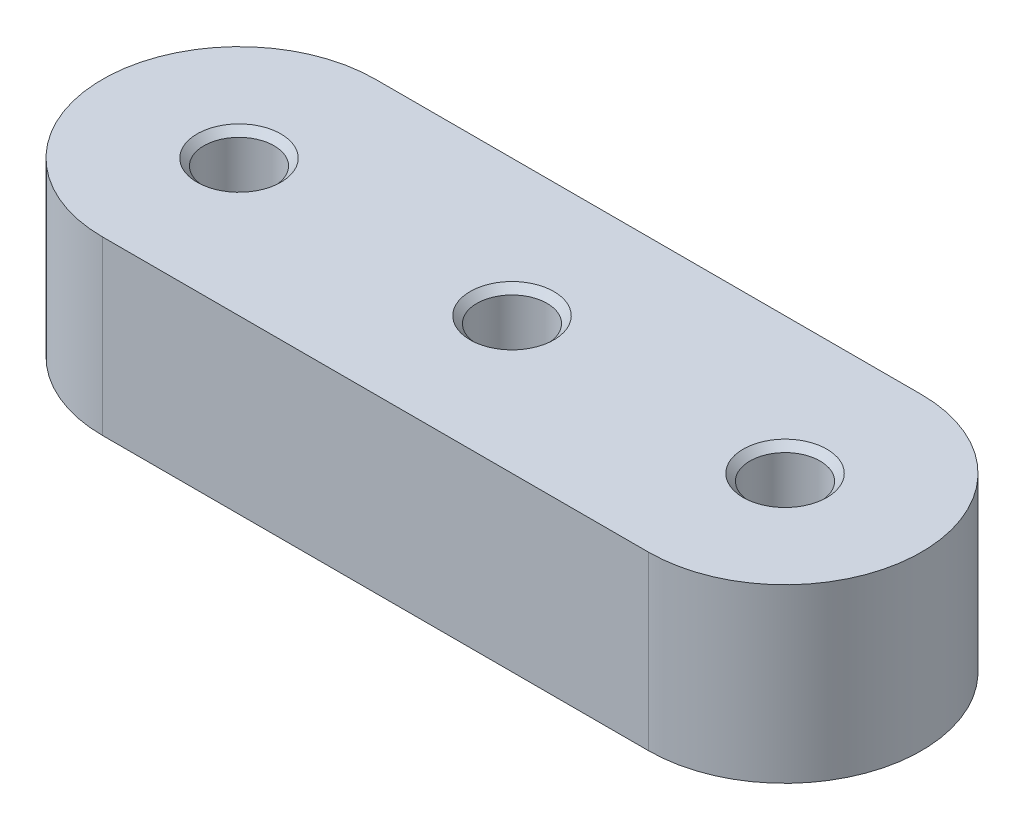
ISO-10303-21;
HEADER;
FILE_DESCRIPTION(('STEP AP214'),'2;1');
FILE_NAME('part.step','',(''),(''),'','','');
FILE_SCHEMA(('AUTOMOTIVE_DESIGN { 1 0 10303 214 1 1 1 1 }'));
ENDSEC;
DATA;
#1=APPLICATION_CONTEXT('core data for automotive mechanical design processes');
#2=APPLICATION_PROTOCOL_DEFINITION('international standard','automotive_design',2000,#1);
#3=PRODUCT_CONTEXT('',#1,'mechanical');
#4=PRODUCT('Part','Part','',(#3));
#5=PRODUCT_RELATED_PRODUCT_CATEGORY('part','',(#4));
#6=PRODUCT_DEFINITION_FORMATION('','',#4);
#7=PRODUCT_DEFINITION_CONTEXT('part definition',#1,'design');
#8=PRODUCT_DEFINITION('design','',#6,#7);
#9=PRODUCT_DEFINITION_SHAPE('','',#8);
#10=(LENGTH_UNIT() NAMED_UNIT(*) SI_UNIT(.MILLI.,.METRE.));
#11=(NAMED_UNIT(*) PLANE_ANGLE_UNIT() SI_UNIT($,.RADIAN.));
#12=(NAMED_UNIT(*) SI_UNIT($,.STERADIAN.) SOLID_ANGLE_UNIT());
#13=UNCERTAINTY_MEASURE_WITH_UNIT(LENGTH_MEASURE(1.E-05),#10,'distance_accuracy_value','');
#14=(GEOMETRIC_REPRESENTATION_CONTEXT(3) GLOBAL_UNCERTAINTY_ASSIGNED_CONTEXT((#13)) GLOBAL_UNIT_ASSIGNED_CONTEXT((#10,
#11,#12)) REPRESENTATION_CONTEXT('',''));
#15=CARTESIAN_POINT('',(0.,0.,0.));
#16=DIRECTION('',(0.,0.,1.));
#17=DIRECTION('',(1.,0.,0.));
#18=AXIS2_PLACEMENT_3D('',#15,#16,#17);
#19=CARTESIAN_POINT('',(-25.4,-16.,0.));
#20=DIRECTION('',(0.,1.,0.));
#21=DIRECTION('',(0.,0.,1.));
#22=AXIS2_PLACEMENT_3D('',#19,#20,#21);
#23=CYLINDRICAL_SURFACE('',#22,12.7);
#24=CARTESIAN_POINT('',(-25.4,0.,0.));
#25=DIRECTION('',(0.,1.,0.));
#26=DIRECTION('',(0.,0.,1.));
#27=AXIS2_PLACEMENT_3D('',#24,#25,#26);
#28=CIRCLE('',#27,12.7);
#29=CARTESIAN_POINT('',(-25.4,0.,-12.7));
#30=VERTEX_POINT('',#29);
#31=CARTESIAN_POINT('',(-25.4,0.,12.7));
#32=VERTEX_POINT('',#31);
#33=EDGE_CURVE('E99',#30,#32,#28,.T.);
#34=ORIENTED_EDGE('',*,*,#33,.F.);
#35=DIRECTION('',(0.,1.,0.));
#36=VECTOR('',#35,1.);
#37=CARTESIAN_POINT('',(-25.4,-16.,-12.7));
#38=LINE('',#37,#36);
#39=CARTESIAN_POINT('',(-25.4,-16.,-12.7));
#40=VERTEX_POINT('',#39);
#41=EDGE_CURVE('E11',#40,#30,#38,.T.);
#42=ORIENTED_EDGE('',*,*,#41,.F.);
#43=CARTESIAN_POINT('',(-25.4,-16.,0.));
#44=DIRECTION('',(0.,1.,0.));
#45=DIRECTION('',(0.,0.,1.));
#46=AXIS2_PLACEMENT_3D('',#43,#44,#45);
#47=CIRCLE('',#46,12.7);
#48=CARTESIAN_POINT('',(-25.4,-16.,12.7));
#49=VERTEX_POINT('',#48);
#50=EDGE_CURVE('E92',#40,#49,#47,.T.);
#51=ORIENTED_EDGE('',*,*,#50,.T.);
#52=DIRECTION('',(0.,1.,0.));
#53=VECTOR('',#52,1.);
#54=CARTESIAN_POINT('',(-25.4,-16.,12.7));
#55=LINE('',#54,#53);
#56=EDGE_CURVE('E37',#49,#32,#55,.T.);
#57=ORIENTED_EDGE('',*,*,#56,.T.);
#58=EDGE_LOOP('',(#34,#42,#51,#57));
#59=FACE_BOUND('',#58,.T.);
#60=ADVANCED_FACE('F34',(#59),#23,.T.);
#61=CARTESIAN_POINT('',(-25.4,-16.,-12.7));
#62=DIRECTION('',(0.,0.,-1.));
#63=DIRECTION('',(-1.,0.,0.));
#64=AXIS2_PLACEMENT_3D('',#61,#62,#63);
#65=PLANE('',#64);
#66=DIRECTION('',(-1.,0.,0.));
#67=VECTOR('',#66,1.);
#68=CARTESIAN_POINT('',(-25.4,0.,-12.7));
#69=LINE('',#68,#67);
#70=CARTESIAN_POINT('',(25.4,0.,-12.7));
#71=VERTEX_POINT('',#70);
#72=EDGE_CURVE('E94',#71,#30,#69,.T.);
#73=ORIENTED_EDGE('',*,*,#72,.F.);
#74=DIRECTION('',(0.,1.,0.));
#75=VECTOR('',#74,1.);
#76=CARTESIAN_POINT('',(25.4,-16.,-12.7));
#77=LINE('',#76,#75);
#78=CARTESIAN_POINT('',(25.4,-16.,-12.7));
#79=VERTEX_POINT('',#78);
#80=EDGE_CURVE('E43',#79,#71,#77,.T.);
#81=ORIENTED_EDGE('',*,*,#80,.F.);
#82=DIRECTION('',(-1.,0.,0.));
#83=VECTOR('',#82,1.);
#84=CARTESIAN_POINT('',(-25.4,-16.,-12.7));
#85=LINE('',#84,#83);
#86=EDGE_CURVE('E89',#79,#40,#85,.T.);
#87=ORIENTED_EDGE('',*,*,#86,.T.);
#88=ORIENTED_EDGE('',*,*,#41,.T.);
#89=EDGE_LOOP('',(#73,#81,#87,#88));
#90=FACE_BOUND('',#89,.T.);
#91=ADVANCED_FACE('F110',(#90),#65,.T.);
#92=CARTESIAN_POINT('',(25.4,-16.,0.));
#93=DIRECTION('',(0.,1.,0.));
#94=DIRECTION('',(0.,0.,1.));
#95=AXIS2_PLACEMENT_3D('',#92,#93,#94);
#96=CYLINDRICAL_SURFACE('',#95,12.7);
#97=CARTESIAN_POINT('',(25.4,0.,0.));
#98=DIRECTION('',(0.,1.,0.));
#99=DIRECTION('',(0.,0.,1.));
#100=AXIS2_PLACEMENT_3D('',#97,#98,#99);
#101=CIRCLE('',#100,12.7);
#102=CARTESIAN_POINT('',(25.4,0.,12.7));
#103=VERTEX_POINT('',#102);
#104=EDGE_CURVE('E84',#103,#71,#101,.T.);
#105=ORIENTED_EDGE('',*,*,#104,.F.);
#106=DIRECTION('',(0.,1.,0.));
#107=VECTOR('',#106,1.);
#108=CARTESIAN_POINT('',(25.4,-16.,12.7));
#109=LINE('',#108,#107);
#110=CARTESIAN_POINT('',(25.4,-16.,12.7));
#111=VERTEX_POINT('',#110);
#112=EDGE_CURVE('E79',#111,#103,#109,.T.);
#113=ORIENTED_EDGE('',*,*,#112,.F.);
#114=CARTESIAN_POINT('',(25.4,-16.,0.));
#115=DIRECTION('',(0.,1.,0.));
#116=DIRECTION('',(0.,0.,1.));
#117=AXIS2_PLACEMENT_3D('',#114,#115,#116);
#118=CIRCLE('',#117,12.7);
#119=EDGE_CURVE('E82',#111,#79,#118,.T.);
#120=ORIENTED_EDGE('',*,*,#119,.T.);
#121=ORIENTED_EDGE('',*,*,#80,.T.);
#122=EDGE_LOOP('',(#105,#113,#120,#121));
#123=FACE_BOUND('',#122,.T.);
#124=ADVANCED_FACE('F81',(#123),#96,.T.);
#125=CARTESIAN_POINT('',(-25.4,-16.,12.7));
#126=DIRECTION('',(0.,0.,1.));
#127=DIRECTION('',(1.,0.,0.));
#128=AXIS2_PLACEMENT_3D('',#125,#126,#127);
#129=PLANE('',#128);
#130=DIRECTION('',(1.,0.,0.));
#131=VECTOR('',#130,1.);
#132=CARTESIAN_POINT('',(-25.4,0.,12.7));
#133=LINE('',#132,#131);
#134=EDGE_CURVE('E102',#32,#103,#133,.T.);
#135=ORIENTED_EDGE('',*,*,#134,.F.);
#136=ORIENTED_EDGE('',*,*,#56,.F.);
#137=DIRECTION('',(1.,0.,0.));
#138=VECTOR('',#137,1.);
#139=CARTESIAN_POINT('',(-25.4,-16.,12.7));
#140=LINE('',#139,#138);
#141=EDGE_CURVE('E88',#49,#111,#140,.T.);
#142=ORIENTED_EDGE('',*,*,#141,.T.);
#143=ORIENTED_EDGE('',*,*,#112,.T.);
#144=EDGE_LOOP('',(#135,#136,#142,#143));
#145=FACE_BOUND('',#144,.T.);
#146=ADVANCED_FACE('F91',(#145),#129,.T.);
#147=CARTESIAN_POINT('',(-25.4,-16.,0.));
#148=DIRECTION('',(0.,1.,0.));
#149=DIRECTION('',(0.,0.,1.));
#150=AXIS2_PLACEMENT_3D('',#147,#148,#149);
#151=PLANE('',#150);
#152=CARTESIAN_POINT('',(0.,-16.,0.));
#153=DIRECTION('',(0.,1.,0.));
#154=DIRECTION('',(0.,0.,1.));
#155=AXIS2_PLACEMENT_3D('',#152,#153,#154);
#156=CIRCLE('',#155,3.8989);
#157=CARTESIAN_POINT('',(0.,-16.,3.8989));
#158=VERTEX_POINT('',#157);
#159=EDGE_CURVE('E176',#158,#158,#156,.T.);
#160=ORIENTED_EDGE('',*,*,#159,.T.);
#161=EDGE_LOOP('',(#160));
#162=FACE_BOUND('',#161,.T.);
#163=CARTESIAN_POINT('',(-25.4,-16.,0.));
#164=DIRECTION('',(0.,1.,0.));
#165=DIRECTION('',(0.,0.,1.));
#166=AXIS2_PLACEMENT_3D('',#163,#164,#165);
#167=CIRCLE('',#166,3.8989);
#168=CARTESIAN_POINT('',(-25.4,-16.,3.89889999999998));
#169=VERTEX_POINT('',#168);
#170=EDGE_CURVE('E184',#169,#169,#167,.T.);
#171=ORIENTED_EDGE('',*,*,#170,.T.);
#172=EDGE_LOOP('',(#171));
#173=FACE_BOUND('',#172,.T.);
#174=CARTESIAN_POINT('',(25.4,-16.,0.));
#175=DIRECTION('',(0.,1.,0.));
#176=DIRECTION('',(0.,0.,1.));
#177=AXIS2_PLACEMENT_3D('',#174,#175,#176);
#178=CIRCLE('',#177,3.8989);
#179=CARTESIAN_POINT('',(25.4,-16.,3.89890000000001));
#180=VERTEX_POINT('',#179);
#181=EDGE_CURVE('E196',#180,#180,#178,.T.);
#182=ORIENTED_EDGE('',*,*,#181,.T.);
#183=EDGE_LOOP('',(#182));
#184=FACE_BOUND('',#183,.T.);
#185=ORIENTED_EDGE('',*,*,#50,.F.);
#186=ORIENTED_EDGE('',*,*,#86,.F.);
#187=ORIENTED_EDGE('',*,*,#119,.F.);
#188=ORIENTED_EDGE('',*,*,#141,.F.);
#189=EDGE_LOOP('',(#185,#186,#187,#188));
#190=FACE_BOUND('',#189,.T.);
#191=ADVANCED_FACE('F87',(#162,#173,#184,#190),#151,.F.);
#192=CARTESIAN_POINT('',(-25.4,0.,0.));
#193=DIRECTION('',(0.,1.,0.));
#194=DIRECTION('',(0.,0.,1.));
#195=AXIS2_PLACEMENT_3D('',#192,#193,#194);
#196=PLANE('',#195);
#197=CARTESIAN_POINT('',(0.,0.,0.));
#198=DIRECTION('',(0.,1.,0.));
#199=DIRECTION('',(0.,0.,1.));
#200=AXIS2_PLACEMENT_3D('',#197,#198,#199);
#201=CIRCLE('',#200,3.8989);
#202=CARTESIAN_POINT('',(0.,0.,3.8989));
#203=VERTEX_POINT('',#202);
#204=EDGE_CURVE('E175',#203,#203,#201,.T.);
#205=ORIENTED_EDGE('',*,*,#204,.F.);
#206=EDGE_LOOP('',(#205));
#207=FACE_BOUND('',#206,.T.);
#208=CARTESIAN_POINT('',(-25.4,0.,0.));
#209=DIRECTION('',(0.,1.,0.));
#210=DIRECTION('',(0.,0.,1.));
#211=AXIS2_PLACEMENT_3D('',#208,#209,#210);
#212=CIRCLE('',#211,3.8989);
#213=CARTESIAN_POINT('',(-25.4,0.,3.89889999999999));
#214=VERTEX_POINT('',#213);
#215=EDGE_CURVE('E187',#214,#214,#212,.T.);
#216=ORIENTED_EDGE('',*,*,#215,.F.);
#217=EDGE_LOOP('',(#216));
#218=FACE_BOUND('',#217,.T.);
#219=CARTESIAN_POINT('',(25.4,0.,0.));
#220=DIRECTION('',(0.,1.,0.));
#221=DIRECTION('',(0.,0.,1.));
#222=AXIS2_PLACEMENT_3D('',#219,#220,#221);
#223=CIRCLE('',#222,3.8989);
#224=CARTESIAN_POINT('',(25.4,0.,3.89890000000002));
#225=VERTEX_POINT('',#224);
#226=EDGE_CURVE('E199',#225,#225,#223,.T.);
#227=ORIENTED_EDGE('',*,*,#226,.F.);
#228=EDGE_LOOP('',(#227));
#229=FACE_BOUND('',#228,.T.);
#230=ORIENTED_EDGE('',*,*,#33,.T.);
#231=ORIENTED_EDGE('',*,*,#134,.T.);
#232=ORIENTED_EDGE('',*,*,#104,.T.);
#233=ORIENTED_EDGE('',*,*,#72,.T.);
#234=EDGE_LOOP('',(#230,#231,#232,#233));
#235=FACE_BOUND('',#234,.T.);
#236=ADVANCED_FACE('F109',(#207,#218,#229,#235),#196,.T.);
#237=CARTESIAN_POINT('',(25.4,-15.365,0.));
#238=DIRECTION('',(0.,-1.,0.));
#239=DIRECTION('',(0.,0.,-1.));
#240=AXIS2_PLACEMENT_3D('',#237,#238,#239);
#241=CONICAL_SURFACE('',#240,3.2639,0.78539816339745);
#242=ORIENTED_EDGE('',*,*,#181,.F.);
#243=EDGE_LOOP('',(#242));
#244=FACE_BOUND('',#243,.T.);
#245=CARTESIAN_POINT('',(25.4,-15.365,0.));
#246=DIRECTION('',(0.,1.,0.));
#247=DIRECTION('',(0.,0.,1.));
#248=AXIS2_PLACEMENT_3D('',#245,#246,#247);
#249=CIRCLE('',#248,3.2639);
#250=CARTESIAN_POINT('',(25.4,-15.365,3.26390000000001));
#251=VERTEX_POINT('',#250);
#252=EDGE_CURVE('E103',#251,#251,#249,.T.);
#253=ORIENTED_EDGE('',*,*,#252,.T.);
#254=EDGE_LOOP('',(#253));
#255=FACE_BOUND('',#254,.T.);
#256=ADVANCED_FACE('F128',(#244,#255),#241,.F.);
#257=CARTESIAN_POINT('',(25.4,0.,0.));
#258=DIRECTION('',(0.,1.,0.));
#259=DIRECTION('',(0.,0.,1.));
#260=AXIS2_PLACEMENT_3D('',#257,#258,#259);
#261=CYLINDRICAL_SURFACE('',#260,3.2639);
#262=ORIENTED_EDGE('',*,*,#252,.F.);
#263=EDGE_LOOP('',(#262));
#264=FACE_BOUND('',#263,.T.);
#265=CARTESIAN_POINT('',(25.4,-0.635,0.));
#266=DIRECTION('',(0.,1.,0.));
#267=DIRECTION('',(0.,0.,1.));
#268=AXIS2_PLACEMENT_3D('',#265,#266,#267);
#269=CIRCLE('',#268,3.2639);
#270=CARTESIAN_POINT('',(25.4,-0.635,3.26390000000002));
#271=VERTEX_POINT('',#270);
#272=EDGE_CURVE('E202',#271,#271,#269,.T.);
#273=ORIENTED_EDGE('',*,*,#272,.T.);
#274=EDGE_LOOP('',(#273));
#275=FACE_BOUND('',#274,.T.);
#276=ADVANCED_FACE('F135',(#264,#275),#261,.F.);
#277=CARTESIAN_POINT('',(25.4,0.,0.));
#278=DIRECTION('',(0.,1.,0.));
#279=DIRECTION('',(0.,0.,1.));
#280=AXIS2_PLACEMENT_3D('',#277,#278,#279);
#281=CONICAL_SURFACE('',#280,3.8989,0.785398163397447);
#282=ORIENTED_EDGE('',*,*,#272,.F.);
#283=EDGE_LOOP('',(#282));
#284=FACE_BOUND('',#283,.T.);
#285=ORIENTED_EDGE('',*,*,#226,.T.);
#286=EDGE_LOOP('',(#285));
#287=FACE_BOUND('',#286,.T.);
#288=ADVANCED_FACE('F139',(#284,#287),#281,.F.);
#289=CARTESIAN_POINT('',(-25.4,-15.365,0.));
#290=DIRECTION('',(0.,-1.,0.));
#291=DIRECTION('',(0.,0.,-1.));
#292=AXIS2_PLACEMENT_3D('',#289,#290,#291);
#293=CONICAL_SURFACE('',#292,3.2639,0.78539816339745);
#294=ORIENTED_EDGE('',*,*,#170,.F.);
#295=EDGE_LOOP('',(#294));
#296=FACE_BOUND('',#295,.T.);
#297=CARTESIAN_POINT('',(-25.4,-15.365,0.));
#298=DIRECTION('',(0.,1.,0.));
#299=DIRECTION('',(0.,0.,1.));
#300=AXIS2_PLACEMENT_3D('',#297,#298,#299);
#301=CIRCLE('',#300,3.2639);
#302=CARTESIAN_POINT('',(-25.4,-15.365,3.26389999999998));
#303=VERTEX_POINT('',#302);
#304=EDGE_CURVE('E193',#303,#303,#301,.T.);
#305=ORIENTED_EDGE('',*,*,#304,.T.);
#306=EDGE_LOOP('',(#305));
#307=FACE_BOUND('',#306,.T.);
#308=ADVANCED_FACE('F143',(#296,#307),#293,.F.);
#309=CARTESIAN_POINT('',(-25.4,0.,0.));
#310=DIRECTION('',(0.,1.,0.));
#311=DIRECTION('',(0.,0.,1.));
#312=AXIS2_PLACEMENT_3D('',#309,#310,#311);
#313=CYLINDRICAL_SURFACE('',#312,3.2639);
#314=ORIENTED_EDGE('',*,*,#304,.F.);
#315=EDGE_LOOP('',(#314));
#316=FACE_BOUND('',#315,.T.);
#317=CARTESIAN_POINT('',(-25.4,-0.635,0.));
#318=DIRECTION('',(0.,1.,0.));
#319=DIRECTION('',(0.,0.,1.));
#320=AXIS2_PLACEMENT_3D('',#317,#318,#319);
#321=CIRCLE('',#320,3.2639);
#322=CARTESIAN_POINT('',(-25.4,-0.635,3.26389999999999));
#323=VERTEX_POINT('',#322);
#324=EDGE_CURVE('E190',#323,#323,#321,.T.);
#325=ORIENTED_EDGE('',*,*,#324,.T.);
#326=EDGE_LOOP('',(#325));
#327=FACE_BOUND('',#326,.T.);
#328=ADVANCED_FACE('F147',(#316,#327),#313,.F.);
#329=CARTESIAN_POINT('',(-25.4,0.,0.));
#330=DIRECTION('',(0.,1.,0.));
#331=DIRECTION('',(0.,0.,1.));
#332=AXIS2_PLACEMENT_3D('',#329,#330,#331);
#333=CONICAL_SURFACE('',#332,3.8989,0.785398163397447);
#334=ORIENTED_EDGE('',*,*,#324,.F.);
#335=EDGE_LOOP('',(#334));
#336=FACE_BOUND('',#335,.T.);
#337=ORIENTED_EDGE('',*,*,#215,.T.);
#338=EDGE_LOOP('',(#337));
#339=FACE_BOUND('',#338,.T.);
#340=ADVANCED_FACE('F151',(#336,#339),#333,.F.);
#341=CARTESIAN_POINT('',(0.,-15.365,0.));
#342=DIRECTION('',(0.,-1.,0.));
#343=DIRECTION('',(0.,0.,-1.));
#344=AXIS2_PLACEMENT_3D('',#341,#342,#343);
#345=CONICAL_SURFACE('',#344,3.2639,0.785398163397449);
#346=ORIENTED_EDGE('',*,*,#159,.F.);
#347=EDGE_LOOP('',(#346));
#348=FACE_BOUND('',#347,.T.);
#349=CARTESIAN_POINT('',(0.,-15.365,0.));
#350=DIRECTION('',(0.,1.,0.));
#351=DIRECTION('',(0.,0.,1.));
#352=AXIS2_PLACEMENT_3D('',#349,#350,#351);
#353=CIRCLE('',#352,3.2639);
#354=CARTESIAN_POINT('',(0.,-15.365,3.2639));
#355=VERTEX_POINT('',#354);
#356=EDGE_CURVE('E178',#355,#355,#353,.T.);
#357=ORIENTED_EDGE('',*,*,#356,.T.);
#358=EDGE_LOOP('',(#357));
#359=FACE_BOUND('',#358,.T.);
#360=ADVANCED_FACE('F155',(#348,#359),#345,.F.);
#361=CARTESIAN_POINT('',(0.,0.,0.));
#362=DIRECTION('',(0.,1.,0.));
#363=DIRECTION('',(0.,0.,1.));
#364=AXIS2_PLACEMENT_3D('',#361,#362,#363);
#365=CYLINDRICAL_SURFACE('',#364,3.2639);
#366=ORIENTED_EDGE('',*,*,#356,.F.);
#367=EDGE_LOOP('',(#366));
#368=FACE_BOUND('',#367,.T.);
#369=CARTESIAN_POINT('',(0.,-0.635,0.));
#370=DIRECTION('',(0.,1.,0.));
#371=DIRECTION('',(0.,0.,1.));
#372=AXIS2_PLACEMENT_3D('',#369,#370,#371);
#373=CIRCLE('',#372,3.2639);
#374=CARTESIAN_POINT('',(0.,-0.635,3.2639));
#375=VERTEX_POINT('',#374);
#376=EDGE_CURVE('E172',#375,#375,#373,.T.);
#377=ORIENTED_EDGE('',*,*,#376,.T.);
#378=EDGE_LOOP('',(#377));
#379=FACE_BOUND('',#378,.T.);
#380=ADVANCED_FACE('F159',(#368,#379),#365,.F.);
#381=CARTESIAN_POINT('',(0.,0.,0.));
#382=DIRECTION('',(0.,1.,0.));
#383=DIRECTION('',(0.,0.,1.));
#384=AXIS2_PLACEMENT_3D('',#381,#382,#383);
#385=CONICAL_SURFACE('',#384,3.8989,0.785398163397448);
#386=ORIENTED_EDGE('',*,*,#376,.F.);
#387=EDGE_LOOP('',(#386));
#388=FACE_BOUND('',#387,.T.);
#389=ORIENTED_EDGE('',*,*,#204,.T.);
#390=EDGE_LOOP('',(#389));
#391=FACE_BOUND('',#390,.T.);
#392=ADVANCED_FACE('F163',(#388,#391),#385,.F.);
#393=CLOSED_SHELL('',(#60,#91,#124,#146,#191,#236,#256,#276,#288,#308,#328,#340,#360,#380,#392));
#394=MANIFOLD_SOLID_BREP('B2',#393);
#395=ADVANCED_BREP_SHAPE_REPRESENTATION('',(#18,#394),#14);
#396=SHAPE_DEFINITION_REPRESENTATION(#9,#395);
ENDSEC;
END-ISO-10303-21;
